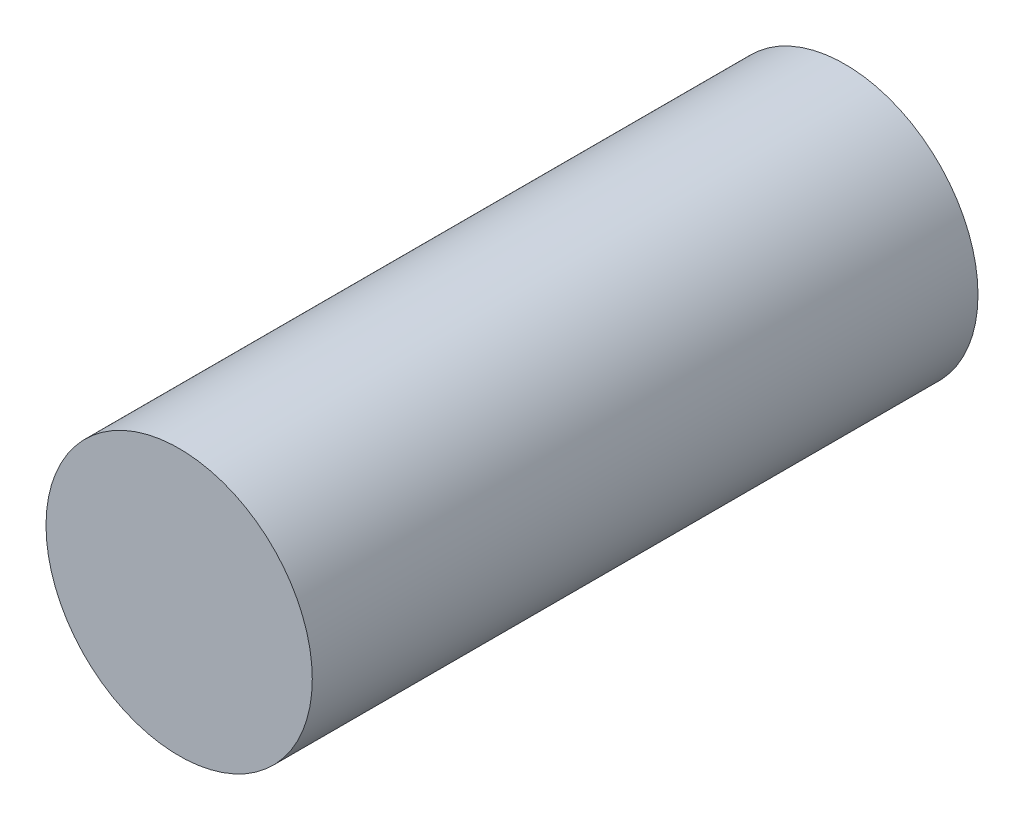
ISO-10303-21;
HEADER;
FILE_DESCRIPTION(('STEP AP214'),'2;1');
FILE_NAME('part.step','',(''),(''),'','','');
FILE_SCHEMA(('AUTOMOTIVE_DESIGN { 1 0 10303 214 1 1 1 1 }'));
ENDSEC;
DATA;
#1=APPLICATION_CONTEXT('core data for automotive mechanical design processes');
#2=APPLICATION_PROTOCOL_DEFINITION('international standard','automotive_design',2000,#1);
#3=PRODUCT_CONTEXT('',#1,'mechanical');
#4=PRODUCT('Part','Part','',(#3));
#5=PRODUCT_RELATED_PRODUCT_CATEGORY('part','',(#4));
#6=PRODUCT_DEFINITION_FORMATION('','',#4);
#7=PRODUCT_DEFINITION_CONTEXT('part definition',#1,'design');
#8=PRODUCT_DEFINITION('design','',#6,#7);
#9=PRODUCT_DEFINITION_SHAPE('','',#8);
#10=(LENGTH_UNIT() NAMED_UNIT(*) SI_UNIT(.MILLI.,.METRE.));
#11=(NAMED_UNIT(*) PLANE_ANGLE_UNIT() SI_UNIT($,.RADIAN.));
#12=(NAMED_UNIT(*) SI_UNIT($,.STERADIAN.) SOLID_ANGLE_UNIT());
#13=UNCERTAINTY_MEASURE_WITH_UNIT(LENGTH_MEASURE(1.E-05),#10,'distance_accuracy_value','');
#14=(GEOMETRIC_REPRESENTATION_CONTEXT(3) GLOBAL_UNCERTAINTY_ASSIGNED_CONTEXT((#13)) GLOBAL_UNIT_ASSIGNED_CONTEXT((#10,
#11,#12)) REPRESENTATION_CONTEXT('',''));
#15=CARTESIAN_POINT('',(0.,0.,0.));
#16=DIRECTION('',(0.,0.,1.));
#17=DIRECTION('',(1.,0.,0.));
#18=AXIS2_PLACEMENT_3D('',#15,#16,#17);
#19=CARTESIAN_POINT('',(-3.41061960439278,2.35734002068324,15.));
#20=DIRECTION('',(0.,0.,-1.));
#21=DIRECTION('',(-1.,0.,0.));
#22=AXIS2_PLACEMENT_3D('',#19,#20,#21);
#23=CYLINDRICAL_SURFACE('',#22,3.);
#24=CARTESIAN_POINT('',(-3.41061960439278,2.35734002068324,15.));
#25=DIRECTION('',(0.,0.,1.));
#26=DIRECTION('',(1.,0.,0.));
#27=AXIS2_PLACEMENT_3D('',#24,#25,#26);
#28=CIRCLE('',#27,3.);
#29=CARTESIAN_POINT('',(-0.410619604392777,2.35734002068324,15.));
#30=VERTEX_POINT('',#29);
#31=EDGE_CURVE('E10',#30,#30,#28,.T.);
#32=ORIENTED_EDGE('',*,*,#31,.F.);
#33=EDGE_LOOP('',(#32));
#34=FACE_BOUND('',#33,.T.);
#35=CARTESIAN_POINT('',(-3.41061960439278,2.35734002068324,0.));
#36=DIRECTION('',(0.,0.,1.));
#37=DIRECTION('',(1.,0.,0.));
#38=AXIS2_PLACEMENT_3D('',#35,#36,#37);
#39=CIRCLE('',#38,3.);
#40=CARTESIAN_POINT('',(-0.410619604392777,2.35734002068324,0.));
#41=VERTEX_POINT('',#40);
#42=EDGE_CURVE('E34',#41,#41,#39,.T.);
#43=ORIENTED_EDGE('',*,*,#42,.T.);
#44=EDGE_LOOP('',(#43));
#45=FACE_BOUND('',#44,.T.);
#46=ADVANCED_FACE('F31',(#34,#45),#23,.T.);
#47=CARTESIAN_POINT('',(-3.41061960439278,2.35734002068324,15.));
#48=DIRECTION('',(0.,0.,1.));
#49=DIRECTION('',(1.,0.,0.));
#50=AXIS2_PLACEMENT_3D('',#47,#48,#49);
#51=PLANE('',#50);
#52=ORIENTED_EDGE('',*,*,#31,.T.);
#53=EDGE_LOOP('',(#52));
#54=FACE_BOUND('',#53,.T.);
#55=ADVANCED_FACE('F46',(#54),#51,.T.);
#56=CARTESIAN_POINT('',(-3.41061960439278,2.35734002068324,0.));
#57=DIRECTION('',(0.,0.,1.));
#58=DIRECTION('',(1.,0.,0.));
#59=AXIS2_PLACEMENT_3D('',#56,#57,#58);
#60=PLANE('',#59);
#61=ORIENTED_EDGE('',*,*,#42,.F.);
#62=EDGE_LOOP('',(#61));
#63=FACE_BOUND('',#62,.T.);
#64=ADVANCED_FACE('F44',(#63),#60,.F.);
#65=CLOSED_SHELL('',(#46,#55,#64));
#66=MANIFOLD_SOLID_BREP('B2',#65);
#67=ADVANCED_BREP_SHAPE_REPRESENTATION('',(#18,#66),#14);
#68=SHAPE_DEFINITION_REPRESENTATION(#9,#67);
ENDSEC;
END-ISO-10303-21;
